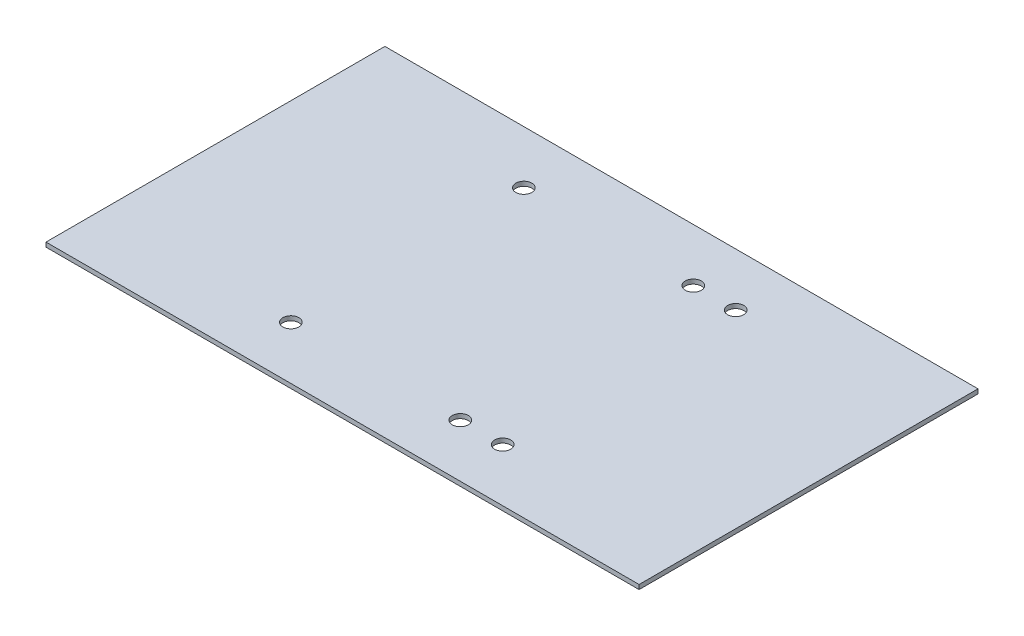
ISO-10303-21;
HEADER;
FILE_DESCRIPTION(('STEP AP214'),'2;1');
FILE_NAME('part.step','',(''),(''),'','','');
FILE_SCHEMA(('AUTOMOTIVE_DESIGN { 1 0 10303 214 1 1 1 1 }'));
ENDSEC;
DATA;
#1=APPLICATION_CONTEXT('core data for automotive mechanical design processes');
#2=APPLICATION_PROTOCOL_DEFINITION('international standard','automotive_design',2000,#1);
#3=PRODUCT_CONTEXT('',#1,'mechanical');
#4=PRODUCT('Part','Part','',(#3));
#5=PRODUCT_RELATED_PRODUCT_CATEGORY('part','',(#4));
#6=PRODUCT_DEFINITION_FORMATION('','',#4);
#7=PRODUCT_DEFINITION_CONTEXT('part definition',#1,'design');
#8=PRODUCT_DEFINITION('design','',#6,#7);
#9=PRODUCT_DEFINITION_SHAPE('','',#8);
#10=(LENGTH_UNIT() NAMED_UNIT(*) SI_UNIT(.MILLI.,.METRE.));
#11=(NAMED_UNIT(*) PLANE_ANGLE_UNIT() SI_UNIT($,.RADIAN.));
#12=(NAMED_UNIT(*) SI_UNIT($,.STERADIAN.) SOLID_ANGLE_UNIT());
#13=UNCERTAINTY_MEASURE_WITH_UNIT(LENGTH_MEASURE(1.E-05),#10,'distance_accuracy_value','');
#14=(GEOMETRIC_REPRESENTATION_CONTEXT(3) GLOBAL_UNCERTAINTY_ASSIGNED_CONTEXT((#13)) GLOBAL_UNIT_ASSIGNED_CONTEXT((#10,
#11,#12)) REPRESENTATION_CONTEXT('',''));
#15=CARTESIAN_POINT('',(0.,0.,0.));
#16=DIRECTION('',(0.,0.,1.));
#17=DIRECTION('',(1.,0.,0.));
#18=AXIS2_PLACEMENT_3D('',#15,#16,#17);
#19=CARTESIAN_POINT('',(0.,-2.65683999999999,0.));
#20=DIRECTION('',(-1.,0.,0.));
#21=DIRECTION('',(0.,0.,1.));
#22=AXIS2_PLACEMENT_3D('',#19,#20,#21);
#23=PLANE('',#22);
#24=DIRECTION('',(0.,0.,1.));
#25=VECTOR('',#24,1.);
#26=CARTESIAN_POINT('',(0.,0.,0.));
#27=LINE('',#26,#25);
#28=CARTESIAN_POINT('',(0.,0.,-203.2));
#29=VERTEX_POINT('',#28);
#30=CARTESIAN_POINT('',(0.,0.,0.));
#31=VERTEX_POINT('',#30);
#32=EDGE_CURVE('E103',#29,#31,#27,.T.);
#33=ORIENTED_EDGE('',*,*,#32,.F.);
#34=DIRECTION('',(0.,1.,0.));
#35=VECTOR('',#34,1.);
#36=CARTESIAN_POINT('',(0.,-2.65683999999999,-203.2));
#37=LINE('',#36,#35);
#38=CARTESIAN_POINT('',(0.,-2.65683999999999,-203.2));
#39=VERTEX_POINT('',#38);
#40=EDGE_CURVE('E11',#39,#29,#37,.T.);
#41=ORIENTED_EDGE('',*,*,#40,.F.);
#42=DIRECTION('',(0.,0.,1.));
#43=VECTOR('',#42,1.);
#44=CARTESIAN_POINT('',(0.,-2.65683999999999,0.));
#45=LINE('',#44,#43);
#46=CARTESIAN_POINT('',(0.,-2.65683999999999,0.));
#47=VERTEX_POINT('',#46);
#48=EDGE_CURVE('E96',#39,#47,#45,.T.);
#49=ORIENTED_EDGE('',*,*,#48,.T.);
#50=DIRECTION('',(0.,1.,0.));
#51=VECTOR('',#50,1.);
#52=CARTESIAN_POINT('',(0.,-2.65683999999999,0.));
#53=LINE('',#52,#51);
#54=EDGE_CURVE('E41',#47,#31,#53,.T.);
#55=ORIENTED_EDGE('',*,*,#54,.T.);
#56=EDGE_LOOP('',(#33,#41,#49,#55));
#57=FACE_BOUND('',#56,.T.);
#58=ADVANCED_FACE('F38',(#57),#23,.T.);
#59=CARTESIAN_POINT('',(0.,-2.65683999999999,-203.2));
#60=DIRECTION('',(0.,0.,-1.));
#61=DIRECTION('',(-1.,0.,0.));
#62=AXIS2_PLACEMENT_3D('',#59,#60,#61);
#63=PLANE('',#62);
#64=DIRECTION('',(-1.,0.,0.));
#65=VECTOR('',#64,1.);
#66=CARTESIAN_POINT('',(0.,0.,-203.2));
#67=LINE('',#66,#65);
#68=CARTESIAN_POINT('',(355.6,0.,-203.2));
#69=VERTEX_POINT('',#68);
#70=EDGE_CURVE('E98',#69,#29,#67,.T.);
#71=ORIENTED_EDGE('',*,*,#70,.F.);
#72=DIRECTION('',(0.,1.,0.));
#73=VECTOR('',#72,1.);
#74=CARTESIAN_POINT('',(355.6,-2.65683999999999,-203.2));
#75=LINE('',#74,#73);
#76=CARTESIAN_POINT('',(355.6,-2.65683999999999,-203.2));
#77=VERTEX_POINT('',#76);
#78=EDGE_CURVE('E47',#77,#69,#75,.T.);
#79=ORIENTED_EDGE('',*,*,#78,.F.);
#80=DIRECTION('',(-1.,0.,0.));
#81=VECTOR('',#80,1.);
#82=CARTESIAN_POINT('',(0.,-2.65683999999999,-203.2));
#83=LINE('',#82,#81);
#84=EDGE_CURVE('E93',#77,#39,#83,.T.);
#85=ORIENTED_EDGE('',*,*,#84,.T.);
#86=ORIENTED_EDGE('',*,*,#40,.T.);
#87=EDGE_LOOP('',(#71,#79,#85,#86));
#88=FACE_BOUND('',#87,.T.);
#89=ADVANCED_FACE('F114',(#88),#63,.T.);
#90=CARTESIAN_POINT('',(355.6,-2.65683999999999,0.));
#91=DIRECTION('',(1.,0.,0.));
#92=DIRECTION('',(0.,0.,-1.));
#93=AXIS2_PLACEMENT_3D('',#90,#91,#92);
#94=PLANE('',#93);
#95=DIRECTION('',(0.,0.,-1.));
#96=VECTOR('',#95,1.);
#97=CARTESIAN_POINT('',(355.6,0.,0.));
#98=LINE('',#97,#96);
#99=CARTESIAN_POINT('',(355.6,0.,0.));
#100=VERTEX_POINT('',#99);
#101=EDGE_CURVE('E88',#100,#69,#98,.T.);
#102=ORIENTED_EDGE('',*,*,#101,.F.);
#103=DIRECTION('',(0.,1.,0.));
#104=VECTOR('',#103,1.);
#105=CARTESIAN_POINT('',(355.6,-2.65683999999999,0.));
#106=LINE('',#105,#104);
#107=CARTESIAN_POINT('',(355.6,-2.65683999999999,0.));
#108=VERTEX_POINT('',#107);
#109=EDGE_CURVE('E83',#108,#100,#106,.T.);
#110=ORIENTED_EDGE('',*,*,#109,.F.);
#111=DIRECTION('',(0.,0.,-1.));
#112=VECTOR('',#111,1.);
#113=CARTESIAN_POINT('',(355.6,-2.65683999999999,0.));
#114=LINE('',#113,#112);
#115=EDGE_CURVE('E86',#108,#77,#114,.T.);
#116=ORIENTED_EDGE('',*,*,#115,.T.);
#117=ORIENTED_EDGE('',*,*,#78,.T.);
#118=EDGE_LOOP('',(#102,#110,#116,#117));
#119=FACE_BOUND('',#118,.T.);
#120=ADVANCED_FACE('F85',(#119),#94,.T.);
#121=CARTESIAN_POINT('',(0.,-2.65683999999999,0.));
#122=DIRECTION('',(0.,0.,1.));
#123=DIRECTION('',(1.,0.,0.));
#124=AXIS2_PLACEMENT_3D('',#121,#122,#123);
#125=PLANE('',#124);
#126=DIRECTION('',(1.,0.,0.));
#127=VECTOR('',#126,1.);
#128=CARTESIAN_POINT('',(0.,0.,0.));
#129=LINE('',#128,#127);
#130=EDGE_CURVE('E106',#31,#100,#129,.T.);
#131=ORIENTED_EDGE('',*,*,#130,.F.);
#132=ORIENTED_EDGE('',*,*,#54,.F.);
#133=DIRECTION('',(1.,0.,0.));
#134=VECTOR('',#133,1.);
#135=CARTESIAN_POINT('',(0.,-2.65683999999999,0.));
#136=LINE('',#135,#134);
#137=EDGE_CURVE('E92',#47,#108,#136,.T.);
#138=ORIENTED_EDGE('',*,*,#137,.T.);
#139=ORIENTED_EDGE('',*,*,#109,.T.);
#140=EDGE_LOOP('',(#131,#132,#138,#139));
#141=FACE_BOUND('',#140,.T.);
#142=ADVANCED_FACE('F95',(#141),#125,.T.);
#143=CARTESIAN_POINT('',(0.,-2.65683999999999,0.));
#144=DIRECTION('',(0.,-1.,0.));
#145=DIRECTION('',(0.,0.,-1.));
#146=AXIS2_PLACEMENT_3D('',#143,#144,#145);
#147=PLANE('',#146);
#148=CARTESIAN_POINT('',(115.062,-2.65683999999999,-31.75));
#149=DIRECTION('',(0.,1.,0.));
#150=DIRECTION('',(0.,0.,1.));
#151=AXIS2_PLACEMENT_3D('',#148,#149,#150);
#152=CIRCLE('',#151,4.82599999999999);
#153=CARTESIAN_POINT('',(115.062,-2.65683999999999,-26.9240000000001));
#154=VERTEX_POINT('',#153);
#155=EDGE_CURVE('E191',#154,#154,#152,.T.);
#156=ORIENTED_EDGE('',*,*,#155,.T.);
#157=EDGE_LOOP('',(#156));
#158=FACE_BOUND('',#157,.T.);
#159=CARTESIAN_POINT('',(216.662,-2.65683999999999,-31.75));
#160=DIRECTION('',(0.,1.,0.));
#161=DIRECTION('',(0.,0.,1.));
#162=AXIS2_PLACEMENT_3D('',#159,#160,#161);
#163=CIRCLE('',#162,4.82599999999999);
#164=CARTESIAN_POINT('',(216.662,-2.65683999999999,-26.9240000000001));
#165=VERTEX_POINT('',#164);
#166=EDGE_CURVE('E185',#165,#165,#163,.T.);
#167=ORIENTED_EDGE('',*,*,#166,.T.);
#168=EDGE_LOOP('',(#167));
#169=FACE_BOUND('',#168,.T.);
#170=CARTESIAN_POINT('',(242.062,-2.65683999999999,-31.75));
#171=DIRECTION('',(0.,1.,0.));
#172=DIRECTION('',(0.,0.,1.));
#173=AXIS2_PLACEMENT_3D('',#170,#171,#172);
#174=CIRCLE('',#173,4.82599999999999);
#175=CARTESIAN_POINT('',(242.062,-2.65683999999999,-26.9240000000001));
#176=VERTEX_POINT('',#175);
#177=EDGE_CURVE('E179',#176,#176,#174,.T.);
#178=ORIENTED_EDGE('',*,*,#177,.T.);
#179=EDGE_LOOP('',(#178));
#180=FACE_BOUND('',#179,.T.);
#181=CARTESIAN_POINT('',(242.062,-2.65683999999999,-171.45));
#182=DIRECTION('',(0.,1.,0.));
#183=DIRECTION('',(0.,0.,1.));
#184=AXIS2_PLACEMENT_3D('',#181,#182,#183);
#185=CIRCLE('',#184,4.82599999999999);
#186=CARTESIAN_POINT('',(242.062,-2.65683999999999,-166.624));
#187=VERTEX_POINT('',#186);
#188=EDGE_CURVE('E169',#187,#187,#185,.T.);
#189=ORIENTED_EDGE('',*,*,#188,.T.);
#190=EDGE_LOOP('',(#189));
#191=FACE_BOUND('',#190,.T.);
#192=CARTESIAN_POINT('',(216.662,-2.65683999999999,-171.45));
#193=DIRECTION('',(0.,1.,0.));
#194=DIRECTION('',(0.,0.,1.));
#195=AXIS2_PLACEMENT_3D('',#192,#193,#194);
#196=CIRCLE('',#195,4.82599999999999);
#197=CARTESIAN_POINT('',(216.662,-2.65683999999999,-166.624));
#198=VERTEX_POINT('',#197);
#199=EDGE_CURVE('E164',#198,#198,#196,.T.);
#200=ORIENTED_EDGE('',*,*,#199,.T.);
#201=EDGE_LOOP('',(#200));
#202=FACE_BOUND('',#201,.T.);
#203=CARTESIAN_POINT('',(115.062,-2.65683999999999,-171.45));
#204=DIRECTION('',(0.,1.,0.));
#205=DIRECTION('',(0.,0.,1.));
#206=AXIS2_PLACEMENT_3D('',#203,#204,#205);
#207=CIRCLE('',#206,4.82599999999999);
#208=CARTESIAN_POINT('',(115.062,-2.65683999999999,-166.624));
#209=VERTEX_POINT('',#208);
#210=EDGE_CURVE('E107',#209,#209,#207,.T.);
#211=ORIENTED_EDGE('',*,*,#210,.T.);
#212=EDGE_LOOP('',(#211));
#213=FACE_BOUND('',#212,.T.);
#214=ORIENTED_EDGE('',*,*,#48,.F.);
#215=ORIENTED_EDGE('',*,*,#84,.F.);
#216=ORIENTED_EDGE('',*,*,#115,.F.);
#217=ORIENTED_EDGE('',*,*,#137,.F.);
#218=EDGE_LOOP('',(#214,#215,#216,#217));
#219=FACE_BOUND('',#218,.T.);
#220=ADVANCED_FACE('F91',(#158,#169,#180,#191,#202,#213,#219),#147,.T.);
#221=CARTESIAN_POINT('',(0.,0.,0.));
#222=DIRECTION('',(0.,-1.,0.));
#223=DIRECTION('',(0.,0.,-1.));
#224=AXIS2_PLACEMENT_3D('',#221,#222,#223);
#225=PLANE('',#224);
#226=CARTESIAN_POINT('',(115.062,0.,-31.75));
#227=DIRECTION('',(0.,1.,0.));
#228=DIRECTION('',(0.,0.,1.));
#229=AXIS2_PLACEMENT_3D('',#226,#227,#228);
#230=CIRCLE('',#229,4.82599999999999);
#231=CARTESIAN_POINT('',(115.062,0.,-26.9240000000001));
#232=VERTEX_POINT('',#231);
#233=EDGE_CURVE('E193',#232,#232,#230,.T.);
#234=ORIENTED_EDGE('',*,*,#233,.F.);
#235=EDGE_LOOP('',(#234));
#236=FACE_BOUND('',#235,.T.);
#237=CARTESIAN_POINT('',(216.662,0.,-31.75));
#238=DIRECTION('',(0.,1.,0.));
#239=DIRECTION('',(0.,0.,1.));
#240=AXIS2_PLACEMENT_3D('',#237,#238,#239);
#241=CIRCLE('',#240,4.82599999999999);
#242=CARTESIAN_POINT('',(216.662,0.,-26.9240000000001));
#243=VERTEX_POINT('',#242);
#244=EDGE_CURVE('E188',#243,#243,#241,.T.);
#245=ORIENTED_EDGE('',*,*,#244,.F.);
#246=EDGE_LOOP('',(#245));
#247=FACE_BOUND('',#246,.T.);
#248=CARTESIAN_POINT('',(242.062,0.,-31.75));
#249=DIRECTION('',(0.,1.,0.));
#250=DIRECTION('',(0.,0.,1.));
#251=AXIS2_PLACEMENT_3D('',#248,#249,#250);
#252=CIRCLE('',#251,4.82599999999999);
#253=CARTESIAN_POINT('',(242.062,0.,-26.9240000000001));
#254=VERTEX_POINT('',#253);
#255=EDGE_CURVE('E182',#254,#254,#252,.T.);
#256=ORIENTED_EDGE('',*,*,#255,.F.);
#257=EDGE_LOOP('',(#256));
#258=FACE_BOUND('',#257,.T.);
#259=CARTESIAN_POINT('',(242.062,0.,-171.45));
#260=DIRECTION('',(0.,1.,0.));
#261=DIRECTION('',(0.,0.,1.));
#262=AXIS2_PLACEMENT_3D('',#259,#260,#261);
#263=CIRCLE('',#262,4.82599999999999);
#264=CARTESIAN_POINT('',(242.062,0.,-166.624));
#265=VERTEX_POINT('',#264);
#266=EDGE_CURVE('E174',#265,#265,#263,.T.);
#267=ORIENTED_EDGE('',*,*,#266,.F.);
#268=EDGE_LOOP('',(#267));
#269=FACE_BOUND('',#268,.T.);
#270=CARTESIAN_POINT('',(216.662,0.,-171.45));
#271=DIRECTION('',(0.,1.,0.));
#272=DIRECTION('',(0.,0.,1.));
#273=AXIS2_PLACEMENT_3D('',#270,#271,#272);
#274=CIRCLE('',#273,4.82599999999999);
#275=CARTESIAN_POINT('',(216.662,0.,-166.624));
#276=VERTEX_POINT('',#275);
#277=EDGE_CURVE('E167',#276,#276,#274,.T.);
#278=ORIENTED_EDGE('',*,*,#277,.F.);
#279=EDGE_LOOP('',(#278));
#280=FACE_BOUND('',#279,.T.);
#281=CARTESIAN_POINT('',(115.062,0.,-171.45));
#282=DIRECTION('',(0.,1.,0.));
#283=DIRECTION('',(0.,0.,1.));
#284=AXIS2_PLACEMENT_3D('',#281,#282,#283);
#285=CIRCLE('',#284,4.82599999999999);
#286=CARTESIAN_POINT('',(115.062,0.,-166.624));
#287=VERTEX_POINT('',#286);
#288=EDGE_CURVE('E171',#287,#287,#285,.T.);
#289=ORIENTED_EDGE('',*,*,#288,.F.);
#290=EDGE_LOOP('',(#289));
#291=FACE_BOUND('',#290,.T.);
#292=ORIENTED_EDGE('',*,*,#32,.T.);
#293=ORIENTED_EDGE('',*,*,#130,.T.);
#294=ORIENTED_EDGE('',*,*,#101,.T.);
#295=ORIENTED_EDGE('',*,*,#70,.T.);
#296=EDGE_LOOP('',(#292,#293,#294,#295));
#297=FACE_BOUND('',#296,.T.);
#298=ADVANCED_FACE('F113',(#236,#247,#258,#269,#280,#291,#297),#225,.F.);
#299=CARTESIAN_POINT('',(115.062,-2.65683999999999,-171.45));
#300=DIRECTION('',(0.,1.,0.));
#301=DIRECTION('',(0.,0.,1.));
#302=AXIS2_PLACEMENT_3D('',#299,#300,#301);
#303=CYLINDRICAL_SURFACE('',#302,4.82599999999999);
#304=ORIENTED_EDGE('',*,*,#210,.F.);
#305=EDGE_LOOP('',(#304));
#306=FACE_BOUND('',#305,.T.);
#307=ORIENTED_EDGE('',*,*,#288,.T.);
#308=EDGE_LOOP('',(#307));
#309=FACE_BOUND('',#308,.T.);
#310=ADVANCED_FACE('F132',(#306,#309),#303,.F.);
#311=CARTESIAN_POINT('',(216.662,-2.65683999999999,-171.45));
#312=DIRECTION('',(0.,1.,0.));
#313=DIRECTION('',(0.,0.,1.));
#314=AXIS2_PLACEMENT_3D('',#311,#312,#313);
#315=CYLINDRICAL_SURFACE('',#314,4.82599999999999);
#316=ORIENTED_EDGE('',*,*,#199,.F.);
#317=EDGE_LOOP('',(#316));
#318=FACE_BOUND('',#317,.T.);
#319=ORIENTED_EDGE('',*,*,#277,.T.);
#320=EDGE_LOOP('',(#319));
#321=FACE_BOUND('',#320,.T.);
#322=ADVANCED_FACE('F139',(#318,#321),#315,.F.);
#323=CARTESIAN_POINT('',(242.062,-2.65683999999999,-171.45));
#324=DIRECTION('',(0.,1.,0.));
#325=DIRECTION('',(0.,0.,1.));
#326=AXIS2_PLACEMENT_3D('',#323,#324,#325);
#327=CYLINDRICAL_SURFACE('',#326,4.82599999999999);
#328=ORIENTED_EDGE('',*,*,#188,.F.);
#329=EDGE_LOOP('',(#328));
#330=FACE_BOUND('',#329,.T.);
#331=ORIENTED_EDGE('',*,*,#266,.T.);
#332=EDGE_LOOP('',(#331));
#333=FACE_BOUND('',#332,.T.);
#334=ADVANCED_FACE('F152',(#330,#333),#327,.F.);
#335=CARTESIAN_POINT('',(242.062,-2.65683999999999,-31.75));
#336=DIRECTION('',(0.,1.,0.));
#337=DIRECTION('',(0.,0.,1.));
#338=AXIS2_PLACEMENT_3D('',#335,#336,#337);
#339=CYLINDRICAL_SURFACE('',#338,4.82599999999999);
#340=ORIENTED_EDGE('',*,*,#177,.F.);
#341=EDGE_LOOP('',(#340));
#342=FACE_BOUND('',#341,.T.);
#343=ORIENTED_EDGE('',*,*,#255,.T.);
#344=EDGE_LOOP('',(#343));
#345=FACE_BOUND('',#344,.T.);
#346=ADVANCED_FACE('F148',(#342,#345),#339,.F.);
#347=CARTESIAN_POINT('',(216.662,-2.65683999999999,-31.75));
#348=DIRECTION('',(0.,1.,0.));
#349=DIRECTION('',(0.,0.,1.));
#350=AXIS2_PLACEMENT_3D('',#347,#348,#349);
#351=CYLINDRICAL_SURFACE('',#350,4.82599999999999);
#352=ORIENTED_EDGE('',*,*,#166,.F.);
#353=EDGE_LOOP('',(#352));
#354=FACE_BOUND('',#353,.T.);
#355=ORIENTED_EDGE('',*,*,#244,.T.);
#356=EDGE_LOOP('',(#355));
#357=FACE_BOUND('',#356,.T.);
#358=ADVANCED_FACE('F144',(#354,#357),#351,.F.);
#359=CARTESIAN_POINT('',(115.062,-2.65683999999999,-31.75));
#360=DIRECTION('',(0.,1.,0.));
#361=DIRECTION('',(0.,0.,1.));
#362=AXIS2_PLACEMENT_3D('',#359,#360,#361);
#363=CYLINDRICAL_SURFACE('',#362,4.82599999999999);
#364=ORIENTED_EDGE('',*,*,#155,.F.);
#365=EDGE_LOOP('',(#364));
#366=FACE_BOUND('',#365,.T.);
#367=ORIENTED_EDGE('',*,*,#233,.T.);
#368=EDGE_LOOP('',(#367));
#369=FACE_BOUND('',#368,.T.);
#370=ADVANCED_FACE('F141',(#366,#369),#363,.F.);
#371=CLOSED_SHELL('',(#58,#89,#120,#142,#220,#298,#310,#322,#334,#346,#358,#370));
#372=MANIFOLD_SOLID_BREP('B2',#371);
#373=ADVANCED_BREP_SHAPE_REPRESENTATION('',(#18,#372),#14);
#374=SHAPE_DEFINITION_REPRESENTATION(#9,#373);
ENDSEC;
END-ISO-10303-21;
